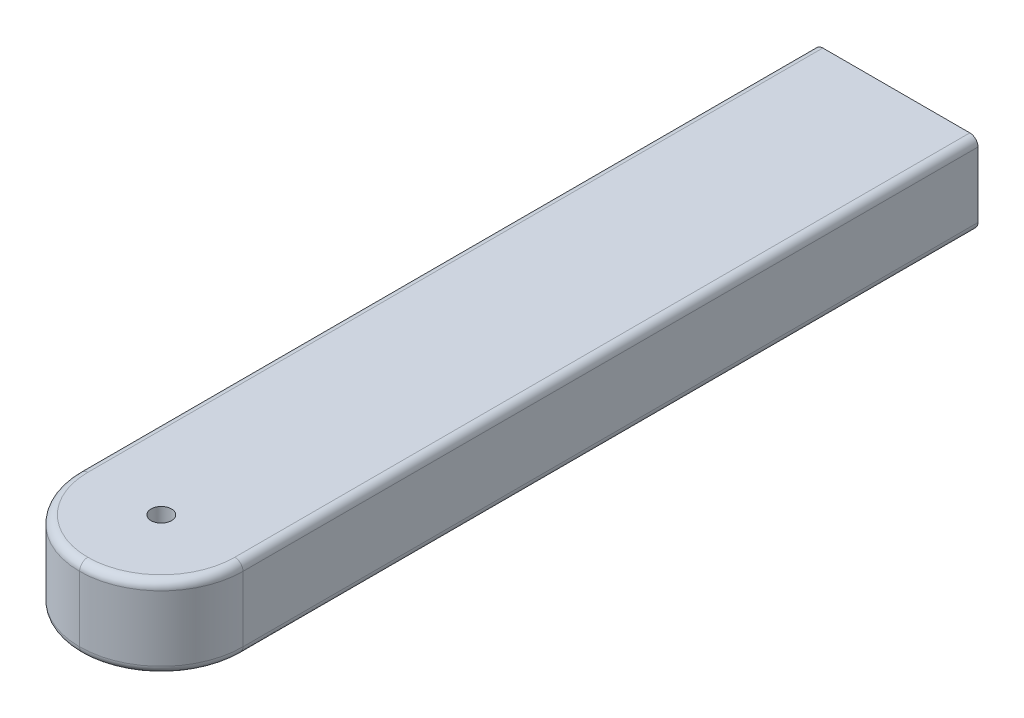
ISO-10303-21;
HEADER;
FILE_DESCRIPTION(('STEP AP214'),'2;1');
FILE_NAME('part.step','',(''),(''),'','','');
FILE_SCHEMA(('AUTOMOTIVE_DESIGN { 1 0 10303 214 1 1 1 1 }'));
ENDSEC;
DATA;
#1=APPLICATION_CONTEXT('core data for automotive mechanical design processes');
#2=APPLICATION_PROTOCOL_DEFINITION('international standard','automotive_design',2000,#1);
#3=PRODUCT_CONTEXT('',#1,'mechanical');
#4=PRODUCT('Part','Part','',(#3));
#5=PRODUCT_RELATED_PRODUCT_CATEGORY('part','',(#4));
#6=PRODUCT_DEFINITION_FORMATION('','',#4);
#7=PRODUCT_DEFINITION_CONTEXT('part definition',#1,'design');
#8=PRODUCT_DEFINITION('design','',#6,#7);
#9=PRODUCT_DEFINITION_SHAPE('','',#8);
#10=(LENGTH_UNIT() NAMED_UNIT(*) SI_UNIT(.MILLI.,.METRE.));
#11=(NAMED_UNIT(*) PLANE_ANGLE_UNIT() SI_UNIT($,.RADIAN.));
#12=(NAMED_UNIT(*) SI_UNIT($,.STERADIAN.) SOLID_ANGLE_UNIT());
#13=UNCERTAINTY_MEASURE_WITH_UNIT(LENGTH_MEASURE(1.E-05),#10,'distance_accuracy_value','');
#14=(GEOMETRIC_REPRESENTATION_CONTEXT(3) GLOBAL_UNCERTAINTY_ASSIGNED_CONTEXT((#13)) GLOBAL_UNIT_ASSIGNED_CONTEXT((#10,
#11,#12)) REPRESENTATION_CONTEXT('',''));
#15=CARTESIAN_POINT('',(0.,0.,0.));
#16=DIRECTION('',(0.,0.,1.));
#17=DIRECTION('',(1.,0.,0.));
#18=AXIS2_PLACEMENT_3D('',#15,#16,#17);
#19=CARTESIAN_POINT('',(0.,0.,254.));
#20=DIRECTION('',(-1.,0.,0.));
#21=DIRECTION('',(0.,-1.,0.));
#22=AXIS2_PLACEMENT_3D('',#19,#20,#21);
#23=PLANE('',#22);
#24=DIRECTION('',(0.,1.,0.));
#25=VECTOR('',#24,1.);
#26=CARTESIAN_POINT('',(0.,0.,0.));
#27=LINE('',#26,#25);
#28=CARTESIAN_POINT('',(0.,2.54,0.));
#29=VERTEX_POINT('',#28);
#30=CARTESIAN_POINT('',(0.,22.86,0.));
#31=VERTEX_POINT('',#30);
#32=EDGE_CURVE('E134',#29,#31,#27,.T.);
#33=ORIENTED_EDGE('',*,*,#32,.T.);
#34=DIRECTION('',(0.,0.,-1.));
#35=VECTOR('',#34,1.);
#36=CARTESIAN_POINT('',(0.,22.86,254.));
#37=LINE('',#36,#35);
#38=CARTESIAN_POINT('',(0.,22.86,228.6));
#39=VERTEX_POINT('',#38);
#40=EDGE_CURVE('E11',#31,#39,#37,.F.);
#41=ORIENTED_EDGE('',*,*,#40,.T.);
#42=DIRECTION('',(0.,1.,0.));
#43=VECTOR('',#42,1.);
#44=CARTESIAN_POINT('',(0.,0.,228.6));
#45=LINE('',#44,#43);
#46=CARTESIAN_POINT('',(0.,2.54,228.6));
#47=VERTEX_POINT('',#46);
#48=EDGE_CURVE('E202',#39,#47,#45,.F.);
#49=ORIENTED_EDGE('',*,*,#48,.T.);
#50=DIRECTION('',(0.,0.,-1.));
#51=VECTOR('',#50,1.);
#52=CARTESIAN_POINT('',(0.,2.54,254.));
#53=LINE('',#52,#51);
#54=EDGE_CURVE('E47',#47,#29,#53,.T.);
#55=ORIENTED_EDGE('',*,*,#54,.T.);
#56=EDGE_LOOP('',(#33,#41,#49,#55));
#57=FACE_BOUND('',#56,.T.);
#58=ADVANCED_FACE('F38',(#57),#23,.F.);
#59=CARTESIAN_POINT('',(0.,25.4,254.));
#60=DIRECTION('',(0.,-1.,0.));
#61=DIRECTION('',(1.,0.,0.));
#62=AXIS2_PLACEMENT_3D('',#59,#60,#61);
#63=PLANE('',#62);
#64=CARTESIAN_POINT('',(-25.4,25.4,228.6));
#65=DIRECTION('',(0.,-1.,0.));
#66=DIRECTION('',(1.,0.,0.));
#67=AXIS2_PLACEMENT_3D('',#64,#65,#66);
#68=CIRCLE('',#67,3.175);
#69=CARTESIAN_POINT('',(-22.225,25.4,228.6));
#70=VERTEX_POINT('',#69);
#71=EDGE_CURVE('E156',#70,#70,#68,.T.);
#72=ORIENTED_EDGE('',*,*,#71,.T.);
#73=EDGE_LOOP('',(#72));
#74=FACE_BOUND('',#73,.T.);
#75=DIRECTION('',(-1.,0.,0.));
#76=VECTOR('',#75,1.);
#77=CARTESIAN_POINT('',(0.,25.4,0.));
#78=LINE('',#77,#76);
#79=CARTESIAN_POINT('',(-2.54,25.4,0.));
#80=VERTEX_POINT('',#79);
#81=CARTESIAN_POINT('',(-48.26,25.4,0.));
#82=VERTEX_POINT('',#81);
#83=EDGE_CURVE('E119',#80,#82,#78,.T.);
#84=ORIENTED_EDGE('',*,*,#83,.T.);
#85=DIRECTION('',(0.,0.,-1.));
#86=VECTOR('',#85,1.);
#87=CARTESIAN_POINT('',(-48.26,25.4,254.));
#88=LINE('',#87,#86);
#89=CARTESIAN_POINT('',(-48.26,25.4,228.6));
#90=VERTEX_POINT('',#89);
#91=EDGE_CURVE('E214',#82,#90,#88,.F.);
#92=ORIENTED_EDGE('',*,*,#91,.T.);
#93=CARTESIAN_POINT('',(-25.4,25.4,228.6));
#94=DIRECTION('',(0.,-1.,0.));
#95=DIRECTION('',(1.,0.,0.));
#96=AXIS2_PLACEMENT_3D('',#93,#94,#95);
#97=CIRCLE('',#96,22.86);
#98=CARTESIAN_POINT('',(-25.4,25.4,251.46));
#99=VERTEX_POINT('',#98);
#100=EDGE_CURVE('E212',#90,#99,#97,.F.);
#101=ORIENTED_EDGE('',*,*,#100,.T.);
#102=CARTESIAN_POINT('',(-25.4,25.4,228.6));
#103=DIRECTION('',(0.,-1.,0.));
#104=DIRECTION('',(1.,0.,0.));
#105=AXIS2_PLACEMENT_3D('',#102,#103,#104);
#106=CIRCLE('',#105,22.86);
#107=CARTESIAN_POINT('',(-2.54,25.4,228.6));
#108=VERTEX_POINT('',#107);
#109=EDGE_CURVE('E123',#99,#108,#106,.F.);
#110=ORIENTED_EDGE('',*,*,#109,.T.);
#111=DIRECTION('',(0.,0.,-1.));
#112=VECTOR('',#111,1.);
#113=CARTESIAN_POINT('',(-2.54,25.4,254.));
#114=LINE('',#113,#112);
#115=EDGE_CURVE('E117',#108,#80,#114,.T.);
#116=ORIENTED_EDGE('',*,*,#115,.T.);
#117=EDGE_LOOP('',(#84,#92,#101,#110,#116));
#118=FACE_BOUND('',#117,.T.);
#119=ADVANCED_FACE('F118',(#74,#118),#63,.F.);
#120=CARTESIAN_POINT('',(-50.8,0.,254.));
#121=DIRECTION('',(1.,0.,0.));
#122=DIRECTION('',(0.,0.,-1.));
#123=AXIS2_PLACEMENT_3D('',#120,#121,#122);
#124=PLANE('',#123);
#125=DIRECTION('',(0.,-1.,0.));
#126=VECTOR('',#125,1.);
#127=CARTESIAN_POINT('',(-50.8,25.4,228.6));
#128=LINE('',#127,#126);
#129=CARTESIAN_POINT('',(-50.8,2.54,228.6));
#130=VERTEX_POINT('',#129);
#131=CARTESIAN_POINT('',(-50.8,22.86,228.6));
#132=VERTEX_POINT('',#131);
#133=EDGE_CURVE('E127',#130,#132,#128,.F.);
#134=ORIENTED_EDGE('',*,*,#133,.T.);
#135=DIRECTION('',(0.,0.,-1.));
#136=VECTOR('',#135,1.);
#137=CARTESIAN_POINT('',(-50.8,22.86,254.));
#138=LINE('',#137,#136);
#139=CARTESIAN_POINT('',(-50.8,22.86,0.));
#140=VERTEX_POINT('',#139);
#141=EDGE_CURVE('E193',#132,#140,#138,.T.);
#142=ORIENTED_EDGE('',*,*,#141,.T.);
#143=DIRECTION('',(0.,-1.,0.));
#144=VECTOR('',#143,1.);
#145=CARTESIAN_POINT('',(-50.8,0.,0.));
#146=LINE('',#145,#144);
#147=CARTESIAN_POINT('',(-50.8,2.54,0.));
#148=VERTEX_POINT('',#147);
#149=EDGE_CURVE('E133',#140,#148,#146,.T.);
#150=ORIENTED_EDGE('',*,*,#149,.T.);
#151=DIRECTION('',(0.,0.,-1.));
#152=VECTOR('',#151,1.);
#153=CARTESIAN_POINT('',(-50.8,2.54,254.));
#154=LINE('',#153,#152);
#155=EDGE_CURVE('E176',#148,#130,#154,.F.);
#156=ORIENTED_EDGE('',*,*,#155,.T.);
#157=EDGE_LOOP('',(#134,#142,#150,#156));
#158=FACE_BOUND('',#157,.T.);
#159=ADVANCED_FACE('F198',(#158),#124,.F.);
#160=CARTESIAN_POINT('',(0.,0.,254.));
#161=DIRECTION('',(0.,1.,0.));
#162=DIRECTION('',(-1.,0.,0.));
#163=AXIS2_PLACEMENT_3D('',#160,#161,#162);
#164=PLANE('',#163);
#165=CARTESIAN_POINT('',(-25.4,0.,228.6));
#166=DIRECTION('',(0.,1.,0.));
#167=DIRECTION('',(-1.,0.,0.));
#168=AXIS2_PLACEMENT_3D('',#165,#166,#167);
#169=CIRCLE('',#168,3.175);
#170=CARTESIAN_POINT('',(-28.575,0.,228.6));
#171=VERTEX_POINT('',#170);
#172=EDGE_CURVE('E396',#171,#171,#169,.T.);
#173=ORIENTED_EDGE('',*,*,#172,.T.);
#174=EDGE_LOOP('',(#173));
#175=FACE_BOUND('',#174,.T.);
#176=DIRECTION('',(1.,0.,0.));
#177=VECTOR('',#176,1.);
#178=CARTESIAN_POINT('',(0.,0.,0.));
#179=LINE('',#178,#177);
#180=CARTESIAN_POINT('',(-48.26,0.,0.));
#181=VERTEX_POINT('',#180);
#182=CARTESIAN_POINT('',(-2.54,0.,0.));
#183=VERTEX_POINT('',#182);
#184=EDGE_CURVE('E195',#181,#183,#179,.T.);
#185=ORIENTED_EDGE('',*,*,#184,.T.);
#186=DIRECTION('',(0.,0.,-1.));
#187=VECTOR('',#186,1.);
#188=CARTESIAN_POINT('',(-2.54,0.,254.));
#189=LINE('',#188,#187);
#190=CARTESIAN_POINT('',(-2.54,0.,228.6));
#191=VERTEX_POINT('',#190);
#192=EDGE_CURVE('E190',#183,#191,#189,.F.);
#193=ORIENTED_EDGE('',*,*,#192,.T.);
#194=CARTESIAN_POINT('',(-25.4,0.,228.6));
#195=DIRECTION('',(0.,1.,0.));
#196=DIRECTION('',(-1.,0.,0.));
#197=AXIS2_PLACEMENT_3D('',#194,#195,#196);
#198=CIRCLE('',#197,22.86);
#199=CARTESIAN_POINT('',(-25.4,0.,251.46));
#200=VERTEX_POINT('',#199);
#201=EDGE_CURVE('E183',#191,#200,#198,.F.);
#202=ORIENTED_EDGE('',*,*,#201,.T.);
#203=CARTESIAN_POINT('',(-25.4,0.,228.6));
#204=DIRECTION('',(0.,1.,0.));
#205=DIRECTION('',(-1.,0.,0.));
#206=AXIS2_PLACEMENT_3D('',#203,#204,#205);
#207=CIRCLE('',#206,22.86);
#208=CARTESIAN_POINT('',(-48.26,0.,228.6));
#209=VERTEX_POINT('',#208);
#210=EDGE_CURVE('E169',#200,#209,#207,.F.);
#211=ORIENTED_EDGE('',*,*,#210,.T.);
#212=DIRECTION('',(0.,0.,-1.));
#213=VECTOR('',#212,1.);
#214=CARTESIAN_POINT('',(-48.26,0.,254.));
#215=LINE('',#214,#213);
#216=EDGE_CURVE('E177',#209,#181,#215,.T.);
#217=ORIENTED_EDGE('',*,*,#216,.T.);
#218=EDGE_LOOP('',(#185,#193,#202,#211,#217));
#219=FACE_BOUND('',#218,.T.);
#220=ADVANCED_FACE('F226',(#175,#219),#164,.F.);
#221=CARTESIAN_POINT('',(0.,0.,0.));
#222=DIRECTION('',(0.,0.,1.));
#223=DIRECTION('',(1.,0.,0.));
#224=AXIS2_PLACEMENT_3D('',#221,#222,#223);
#225=PLANE('',#224);
#226=CARTESIAN_POINT('',(-25.4,12.7,0.));
#227=DIRECTION('',(0.,0.,-1.));
#228=DIRECTION('',(-1.,0.,0.));
#229=AXIS2_PLACEMENT_3D('',#226,#227,#228);
#230=CIRCLE('',#229,3.175);
#231=CARTESIAN_POINT('',(-28.575,12.7,0.));
#232=VERTEX_POINT('',#231);
#233=EDGE_CURVE('E209',#232,#232,#230,.T.);
#234=ORIENTED_EDGE('',*,*,#233,.F.);
#235=EDGE_LOOP('',(#234));
#236=FACE_BOUND('',#235,.T.);
#237=ORIENTED_EDGE('',*,*,#149,.F.);
#238=CARTESIAN_POINT('',(-48.26,22.86,0.));
#239=DIRECTION('',(0.,0.,1.));
#240=DIRECTION('',(1.,0.,0.));
#241=AXIS2_PLACEMENT_3D('',#238,#239,#240);
#242=CIRCLE('',#241,2.54);
#243=EDGE_CURVE('E132',#140,#82,#242,.F.);
#244=ORIENTED_EDGE('',*,*,#243,.T.);
#245=ORIENTED_EDGE('',*,*,#83,.F.);
#246=CARTESIAN_POINT('',(-2.54,22.86,0.));
#247=DIRECTION('',(0.,0.,1.));
#248=DIRECTION('',(1.,0.,0.));
#249=AXIS2_PLACEMENT_3D('',#246,#247,#248);
#250=CIRCLE('',#249,2.54);
#251=EDGE_CURVE('E55',#80,#31,#250,.F.);
#252=ORIENTED_EDGE('',*,*,#251,.T.);
#253=ORIENTED_EDGE('',*,*,#32,.F.);
#254=CARTESIAN_POINT('',(-2.54,2.54,0.));
#255=DIRECTION('',(0.,0.,1.));
#256=DIRECTION('',(1.,0.,0.));
#257=AXIS2_PLACEMENT_3D('',#254,#255,#256);
#258=CIRCLE('',#257,2.54);
#259=EDGE_CURVE('E138',#29,#183,#258,.F.);
#260=ORIENTED_EDGE('',*,*,#259,.T.);
#261=ORIENTED_EDGE('',*,*,#184,.F.);
#262=CARTESIAN_POINT('',(-48.26,2.54,0.));
#263=DIRECTION('',(0.,0.,1.));
#264=DIRECTION('',(1.,0.,0.));
#265=AXIS2_PLACEMENT_3D('',#262,#263,#264);
#266=CIRCLE('',#265,2.54);
#267=EDGE_CURVE('E141',#181,#148,#266,.F.);
#268=ORIENTED_EDGE('',*,*,#267,.T.);
#269=EDGE_LOOP('',(#237,#244,#245,#252,#253,#260,#261,#268));
#270=FACE_BOUND('',#269,.T.);
#271=ADVANCED_FACE('F130',(#236,#270),#225,.F.);
#272=CARTESIAN_POINT('',(-25.4,12.7,25.4));
#273=DIRECTION('',(0.,0.,-1.));
#274=DIRECTION('',(-1.,0.,0.));
#275=AXIS2_PLACEMENT_3D('',#272,#273,#274);
#276=CYLINDRICAL_SURFACE('',#275,3.175);
#277=CARTESIAN_POINT('',(-25.4,12.7,25.4));
#278=DIRECTION('',(0.,0.,-1.));
#279=DIRECTION('',(-1.,0.,0.));
#280=AXIS2_PLACEMENT_3D('',#277,#278,#279);
#281=CIRCLE('',#280,3.175);
#282=CARTESIAN_POINT('',(-28.575,12.7,25.4));
#283=VERTEX_POINT('',#282);
#284=EDGE_CURVE('E389',#283,#283,#281,.T.);
#285=ORIENTED_EDGE('',*,*,#284,.F.);
#286=EDGE_LOOP('',(#285));
#287=FACE_BOUND('',#286,.T.);
#288=ORIENTED_EDGE('',*,*,#233,.T.);
#289=EDGE_LOOP('',(#288));
#290=FACE_BOUND('',#289,.T.);
#291=ADVANCED_FACE('F336',(#287,#290),#276,.F.);
#292=CARTESIAN_POINT('',(-25.4,12.7,25.4));
#293=DIRECTION('',(0.,0.,-1.));
#294=DIRECTION('',(-1.,0.,0.));
#295=AXIS2_PLACEMENT_3D('',#292,#293,#294);
#296=PLANE('',#295);
#297=ORIENTED_EDGE('',*,*,#284,.T.);
#298=EDGE_LOOP('',(#297));
#299=FACE_BOUND('',#298,.T.);
#300=ADVANCED_FACE('F253',(#299),#296,.T.);
#301=CARTESIAN_POINT('',(-25.4,0.,228.6));
#302=DIRECTION('',(0.,1.,0.));
#303=DIRECTION('',(0.,0.,1.));
#304=AXIS2_PLACEMENT_3D('',#301,#302,#303);
#305=CYLINDRICAL_SURFACE('',#304,25.4);
#306=DIRECTION('',(0.,-1.,0.));
#307=VECTOR('',#306,1.);
#308=CARTESIAN_POINT('',(-25.4,0.,254.));
#309=LINE('',#308,#307);
#310=CARTESIAN_POINT('',(-25.4,22.86,254.));
#311=VERTEX_POINT('',#310);
#312=CARTESIAN_POINT('',(-25.4,2.54,254.));
#313=VERTEX_POINT('',#312);
#314=EDGE_CURVE('E153',#311,#313,#309,.T.);
#315=ORIENTED_EDGE('',*,*,#314,.F.);
#316=CARTESIAN_POINT('',(-25.4,22.86,228.6));
#317=DIRECTION('',(0.,-1.,0.));
#318=DIRECTION('',(1.,0.,0.));
#319=AXIS2_PLACEMENT_3D('',#316,#317,#318);
#320=CIRCLE('',#319,25.4);
#321=EDGE_CURVE('E217',#311,#132,#320,.T.);
#322=ORIENTED_EDGE('',*,*,#321,.T.);
#323=ORIENTED_EDGE('',*,*,#133,.F.);
#324=CARTESIAN_POINT('',(-25.4,2.54,228.6));
#325=DIRECTION('',(0.,1.,0.));
#326=DIRECTION('',(-1.,0.,0.));
#327=AXIS2_PLACEMENT_3D('',#324,#325,#326);
#328=CIRCLE('',#327,25.4);
#329=EDGE_CURVE('E171',#130,#313,#328,.T.);
#330=ORIENTED_EDGE('',*,*,#329,.T.);
#331=EDGE_LOOP('',(#315,#322,#323,#330));
#332=FACE_BOUND('',#331,.T.);
#333=ADVANCED_FACE('F250',(#332),#305,.T.);
#334=CARTESIAN_POINT('',(-25.4,0.,228.6));
#335=DIRECTION('',(0.,-1.,0.));
#336=DIRECTION('',(1.,0.,0.));
#337=AXIS2_PLACEMENT_3D('',#334,#335,#336);
#338=CYLINDRICAL_SURFACE('',#337,25.4);
#339=ORIENTED_EDGE('',*,*,#48,.F.);
#340=CARTESIAN_POINT('',(-25.4,22.86,228.6));
#341=DIRECTION('',(0.,-1.,0.));
#342=DIRECTION('',(1.,0.,0.));
#343=AXIS2_PLACEMENT_3D('',#340,#341,#342);
#344=CIRCLE('',#343,25.4);
#345=EDGE_CURVE('E181',#39,#311,#344,.T.);
#346=ORIENTED_EDGE('',*,*,#345,.T.);
#347=ORIENTED_EDGE('',*,*,#314,.T.);
#348=CARTESIAN_POINT('',(-25.4,2.54,228.6));
#349=DIRECTION('',(0.,1.,0.));
#350=DIRECTION('',(-1.,0.,0.));
#351=AXIS2_PLACEMENT_3D('',#348,#349,#350);
#352=CIRCLE('',#351,25.4);
#353=EDGE_CURVE('E185',#313,#47,#352,.T.);
#354=ORIENTED_EDGE('',*,*,#353,.T.);
#355=EDGE_LOOP('',(#339,#346,#347,#354));
#356=FACE_BOUND('',#355,.T.);
#357=ADVANCED_FACE('F220',(#356),#338,.T.);
#358=CARTESIAN_POINT('',(-2.54,22.86,254.));
#359=DIRECTION('',(0.,0.,-1.));
#360=DIRECTION('',(-1.,0.,0.));
#361=AXIS2_PLACEMENT_3D('',#358,#359,#360);
#362=CYLINDRICAL_SURFACE('',#361,2.54);
#363=ORIENTED_EDGE('',*,*,#251,.F.);
#364=ORIENTED_EDGE('',*,*,#115,.F.);
#365=CARTESIAN_POINT('',(-2.54,22.86,228.6));
#366=DIRECTION('',(0.,0.,1.));
#367=DIRECTION('',(1.,0.,0.));
#368=AXIS2_PLACEMENT_3D('',#365,#366,#367);
#369=CIRCLE('',#368,2.54);
#370=EDGE_CURVE('E151',#39,#108,#369,.T.);
#371=ORIENTED_EDGE('',*,*,#370,.F.);
#372=ORIENTED_EDGE('',*,*,#40,.F.);
#373=EDGE_LOOP('',(#363,#364,#371,#372));
#374=FACE_BOUND('',#373,.T.);
#375=ADVANCED_FACE('F137',(#374),#362,.T.);
#376=CARTESIAN_POINT('',(-48.26,22.86,254.));
#377=DIRECTION('',(0.,0.,-1.));
#378=DIRECTION('',(-1.,0.,0.));
#379=AXIS2_PLACEMENT_3D('',#376,#377,#378);
#380=CYLINDRICAL_SURFACE('',#379,2.54);
#381=ORIENTED_EDGE('',*,*,#243,.F.);
#382=ORIENTED_EDGE('',*,*,#141,.F.);
#383=CARTESIAN_POINT('',(-48.26,22.86,228.6));
#384=DIRECTION('',(0.,0.,1.));
#385=DIRECTION('',(1.,0.,0.));
#386=AXIS2_PLACEMENT_3D('',#383,#384,#385);
#387=CIRCLE('',#386,2.54);
#388=EDGE_CURVE('E148',#90,#132,#387,.T.);
#389=ORIENTED_EDGE('',*,*,#388,.F.);
#390=ORIENTED_EDGE('',*,*,#91,.F.);
#391=EDGE_LOOP('',(#381,#382,#389,#390));
#392=FACE_BOUND('',#391,.T.);
#393=ADVANCED_FACE('F262',(#392),#380,.T.);
#394=CARTESIAN_POINT('',(-25.4,22.86,228.6));
#395=DIRECTION('',(0.,-1.,0.));
#396=DIRECTION('',(1.,0.,0.));
#397=AXIS2_PLACEMENT_3D('',#394,#395,#396);
#398=TOROIDAL_SURFACE('',#397,22.86,2.54);
#399=ORIENTED_EDGE('',*,*,#370,.T.);
#400=ORIENTED_EDGE('',*,*,#109,.F.);
#401=CARTESIAN_POINT('',(-25.4,22.86,251.46));
#402=DIRECTION('',(-1.,0.,0.));
#403=DIRECTION('',(0.,0.,1.));
#404=AXIS2_PLACEMENT_3D('',#401,#402,#403);
#405=CIRCLE('',#404,2.54);
#406=EDGE_CURVE('E146',#311,#99,#405,.T.);
#407=ORIENTED_EDGE('',*,*,#406,.F.);
#408=ORIENTED_EDGE('',*,*,#345,.F.);
#409=EDGE_LOOP('',(#399,#400,#407,#408));
#410=FACE_BOUND('',#409,.T.);
#411=ADVANCED_FACE('F258',(#410),#398,.T.);
#412=CARTESIAN_POINT('',(-25.4,22.86,228.6));
#413=DIRECTION('',(0.,-1.,0.));
#414=DIRECTION('',(1.,0.,0.));
#415=AXIS2_PLACEMENT_3D('',#412,#413,#414);
#416=TOROIDAL_SURFACE('',#415,22.86,2.54);
#417=ORIENTED_EDGE('',*,*,#388,.T.);
#418=ORIENTED_EDGE('',*,*,#321,.F.);
#419=ORIENTED_EDGE('',*,*,#406,.T.);
#420=ORIENTED_EDGE('',*,*,#100,.F.);
#421=EDGE_LOOP('',(#417,#418,#419,#420));
#422=FACE_BOUND('',#421,.T.);
#423=ADVANCED_FACE('F255',(#422),#416,.T.);
#424=CARTESIAN_POINT('',(-48.26,2.54,254.));
#425=DIRECTION('',(0.,0.,-1.));
#426=DIRECTION('',(-1.,0.,0.));
#427=AXIS2_PLACEMENT_3D('',#424,#425,#426);
#428=CYLINDRICAL_SURFACE('',#427,2.54);
#429=ORIENTED_EDGE('',*,*,#267,.F.);
#430=ORIENTED_EDGE('',*,*,#216,.F.);
#431=CARTESIAN_POINT('',(-48.26,2.54,228.6));
#432=DIRECTION('',(0.,0.,1.));
#433=DIRECTION('',(1.,0.,0.));
#434=AXIS2_PLACEMENT_3D('',#431,#432,#433);
#435=CIRCLE('',#434,2.54);
#436=EDGE_CURVE('E42',#130,#209,#435,.T.);
#437=ORIENTED_EDGE('',*,*,#436,.F.);
#438=ORIENTED_EDGE('',*,*,#155,.F.);
#439=EDGE_LOOP('',(#429,#430,#437,#438));
#440=FACE_BOUND('',#439,.T.);
#441=ADVANCED_FACE('F40',(#440),#428,.T.);
#442=CARTESIAN_POINT('',(-2.54,2.54,254.));
#443=DIRECTION('',(0.,0.,-1.));
#444=DIRECTION('',(-1.,0.,0.));
#445=AXIS2_PLACEMENT_3D('',#442,#443,#444);
#446=CYLINDRICAL_SURFACE('',#445,2.54);
#447=ORIENTED_EDGE('',*,*,#259,.F.);
#448=ORIENTED_EDGE('',*,*,#54,.F.);
#449=CARTESIAN_POINT('',(-2.54,2.54,228.6));
#450=DIRECTION('',(0.,0.,1.));
#451=DIRECTION('',(1.,0.,0.));
#452=AXIS2_PLACEMENT_3D('',#449,#450,#451);
#453=CIRCLE('',#452,2.54);
#454=EDGE_CURVE('E155',#191,#47,#453,.T.);
#455=ORIENTED_EDGE('',*,*,#454,.F.);
#456=ORIENTED_EDGE('',*,*,#192,.F.);
#457=EDGE_LOOP('',(#447,#448,#455,#456));
#458=FACE_BOUND('',#457,.T.);
#459=ADVANCED_FACE('F224',(#458),#446,.T.);
#460=CARTESIAN_POINT('',(-25.4,2.54,228.6));
#461=DIRECTION('',(0.,1.,0.));
#462=DIRECTION('',(-1.,0.,0.));
#463=AXIS2_PLACEMENT_3D('',#460,#461,#462);
#464=TOROIDAL_SURFACE('',#463,22.86,2.54);
#465=ORIENTED_EDGE('',*,*,#436,.T.);
#466=ORIENTED_EDGE('',*,*,#210,.F.);
#467=CARTESIAN_POINT('',(-25.4,2.54,251.46));
#468=DIRECTION('',(1.,0.,0.));
#469=DIRECTION('',(0.,0.,-1.));
#470=AXIS2_PLACEMENT_3D('',#467,#468,#469);
#471=CIRCLE('',#470,2.54);
#472=EDGE_CURVE('E154',#313,#200,#471,.T.);
#473=ORIENTED_EDGE('',*,*,#472,.F.);
#474=ORIENTED_EDGE('',*,*,#329,.F.);
#475=EDGE_LOOP('',(#465,#466,#473,#474));
#476=FACE_BOUND('',#475,.T.);
#477=ADVANCED_FACE('F167',(#476),#464,.T.);
#478=CARTESIAN_POINT('',(-25.4,2.54,228.6));
#479=DIRECTION('',(0.,1.,0.));
#480=DIRECTION('',(-1.,0.,0.));
#481=AXIS2_PLACEMENT_3D('',#478,#479,#480);
#482=TOROIDAL_SURFACE('',#481,22.86,2.54);
#483=ORIENTED_EDGE('',*,*,#454,.T.);
#484=ORIENTED_EDGE('',*,*,#353,.F.);
#485=ORIENTED_EDGE('',*,*,#472,.T.);
#486=ORIENTED_EDGE('',*,*,#201,.F.);
#487=EDGE_LOOP('',(#483,#484,#485,#486));
#488=FACE_BOUND('',#487,.T.);
#489=ADVANCED_FACE('F227',(#488),#482,.T.);
#490=CARTESIAN_POINT('',(-25.4,0.,228.6));
#491=DIRECTION('',(0.,1.,0.));
#492=DIRECTION('',(-1.,0.,0.));
#493=AXIS2_PLACEMENT_3D('',#490,#491,#492);
#494=CYLINDRICAL_SURFACE('',#493,3.175);
#495=ORIENTED_EDGE('',*,*,#172,.F.);
#496=EDGE_LOOP('',(#495));
#497=FACE_BOUND('',#496,.T.);
#498=ORIENTED_EDGE('',*,*,#71,.F.);
#499=EDGE_LOOP('',(#498));
#500=FACE_BOUND('',#499,.T.);
#501=ADVANCED_FACE('F229',(#497,#500),#494,.F.);
#502=CLOSED_SHELL('',(#58,#119,#159,#220,#271,#291,#300,#333,#357,#375,#393,#411,#423,#441,#459,
#477,#489,#501));
#503=MANIFOLD_SOLID_BREP('B2',#502);
#504=ADVANCED_BREP_SHAPE_REPRESENTATION('',(#18,#503),#14);
#505=SHAPE_DEFINITION_REPRESENTATION(#9,#504);
ENDSEC;
END-ISO-10303-21;
